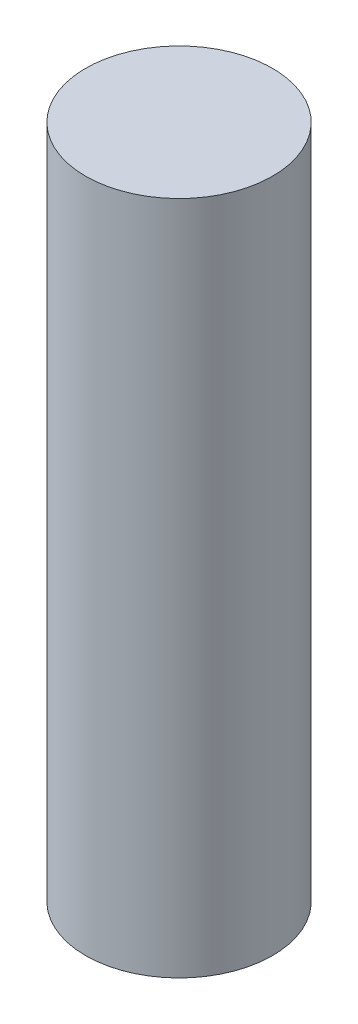
ISO-10303-21;
HEADER;
FILE_DESCRIPTION(('STEP AP214'),'2;1');
FILE_NAME('part.step','',(''),(''),'','','');
FILE_SCHEMA(('AUTOMOTIVE_DESIGN { 1 0 10303 214 1 1 1 1 }'));
ENDSEC;
DATA;
#1=APPLICATION_CONTEXT('core data for automotive mechanical design processes');
#2=APPLICATION_PROTOCOL_DEFINITION('international standard','automotive_design',2000,#1);
#3=PRODUCT_CONTEXT('',#1,'mechanical');
#4=PRODUCT('Part','Part','',(#3));
#5=PRODUCT_RELATED_PRODUCT_CATEGORY('part','',(#4));
#6=PRODUCT_DEFINITION_FORMATION('','',#4);
#7=PRODUCT_DEFINITION_CONTEXT('part definition',#1,'design');
#8=PRODUCT_DEFINITION('design','',#6,#7);
#9=PRODUCT_DEFINITION_SHAPE('','',#8);
#10=(LENGTH_UNIT() NAMED_UNIT(*) SI_UNIT(.MILLI.,.METRE.));
#11=(NAMED_UNIT(*) PLANE_ANGLE_UNIT() SI_UNIT($,.RADIAN.));
#12=(NAMED_UNIT(*) SI_UNIT($,.STERADIAN.) SOLID_ANGLE_UNIT());
#13=UNCERTAINTY_MEASURE_WITH_UNIT(LENGTH_MEASURE(1.E-05),#10,'distance_accuracy_value','');
#14=(GEOMETRIC_REPRESENTATION_CONTEXT(3) GLOBAL_UNCERTAINTY_ASSIGNED_CONTEXT((#13)) GLOBAL_UNIT_ASSIGNED_CONTEXT((#10,
#11,#12)) REPRESENTATION_CONTEXT('',''));
#15=CARTESIAN_POINT('',(0.,0.,0.));
#16=DIRECTION('',(0.,0.,1.));
#17=DIRECTION('',(1.,0.,0.));
#18=AXIS2_PLACEMENT_3D('',#15,#16,#17);
#19=CARTESIAN_POINT('',(0.,65.,0.));
#20=DIRECTION('',(0.,-1.,0.));
#21=DIRECTION('',(0.,0.,-1.));
#22=AXIS2_PLACEMENT_3D('',#19,#20,#21);
#23=CYLINDRICAL_SURFACE('',#22,9.);
#24=CARTESIAN_POINT('',(0.,65.,0.));
#25=DIRECTION('',(0.,1.,0.));
#26=DIRECTION('',(0.,0.,1.));
#27=AXIS2_PLACEMENT_3D('',#24,#25,#26);
#28=CIRCLE('',#27,9.);
#29=CARTESIAN_POINT('',(0.,65.,9.));
#30=VERTEX_POINT('',#29);
#31=EDGE_CURVE('E10',#30,#30,#28,.T.);
#32=ORIENTED_EDGE('',*,*,#31,.F.);
#33=EDGE_LOOP('',(#32));
#34=FACE_BOUND('',#33,.T.);
#35=CARTESIAN_POINT('',(0.,0.,0.));
#36=DIRECTION('',(0.,1.,0.));
#37=DIRECTION('',(0.,0.,1.));
#38=AXIS2_PLACEMENT_3D('',#35,#36,#37);
#39=CIRCLE('',#38,9.);
#40=CARTESIAN_POINT('',(0.,0.,9.));
#41=VERTEX_POINT('',#40);
#42=EDGE_CURVE('E38',#41,#41,#39,.T.);
#43=ORIENTED_EDGE('',*,*,#42,.T.);
#44=EDGE_LOOP('',(#43));
#45=FACE_BOUND('',#44,.T.);
#46=ADVANCED_FACE('F35',(#34,#45),#23,.T.);
#47=CARTESIAN_POINT('',(0.,65.,0.));
#48=DIRECTION('',(0.,1.,0.));
#49=DIRECTION('',(0.,0.,1.));
#50=AXIS2_PLACEMENT_3D('',#47,#48,#49);
#51=PLANE('',#50);
#52=ORIENTED_EDGE('',*,*,#31,.T.);
#53=EDGE_LOOP('',(#52));
#54=FACE_BOUND('',#53,.T.);
#55=ADVANCED_FACE('F50',(#54),#51,.T.);
#56=CARTESIAN_POINT('',(0.,0.,0.));
#57=DIRECTION('',(0.,1.,0.));
#58=DIRECTION('',(0.,0.,1.));
#59=AXIS2_PLACEMENT_3D('',#56,#57,#58);
#60=PLANE('',#59);
#61=ORIENTED_EDGE('',*,*,#42,.F.);
#62=EDGE_LOOP('',(#61));
#63=FACE_BOUND('',#62,.T.);
#64=ADVANCED_FACE('F48',(#63),#60,.F.);
#65=CLOSED_SHELL('',(#46,#55,#64));
#66=MANIFOLD_SOLID_BREP('B2',#65);
#67=ADVANCED_BREP_SHAPE_REPRESENTATION('',(#18,#66),#14);
#68=SHAPE_DEFINITION_REPRESENTATION(#9,#67);
ENDSEC;
END-ISO-10303-21;
